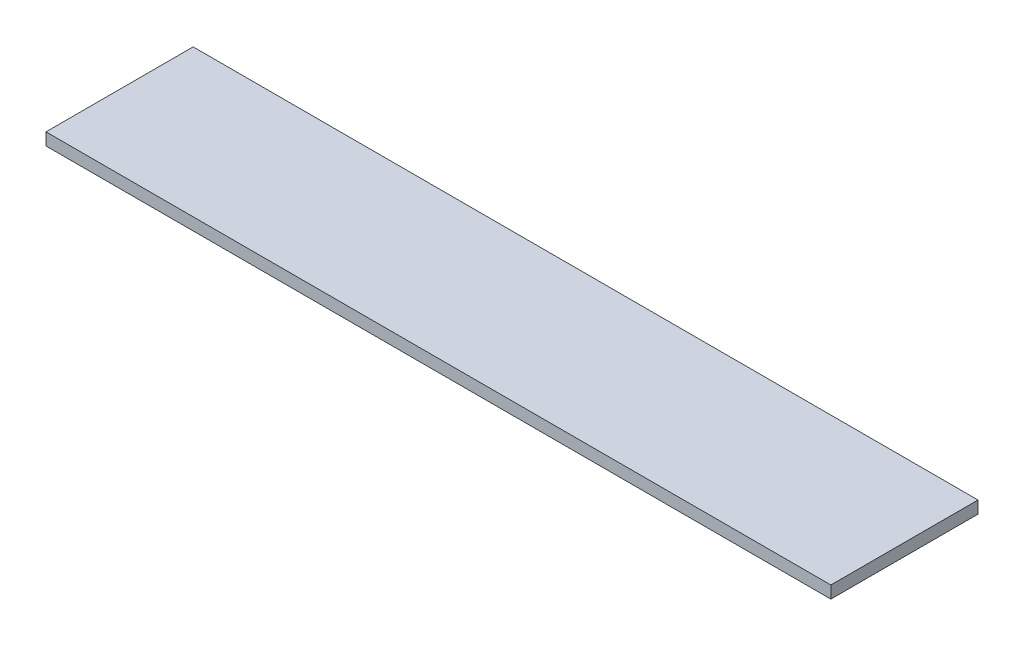
ISO-10303-21;
HEADER;
FILE_DESCRIPTION(('STEP AP214'),'2;1');
FILE_NAME('part.step','',(''),(''),'','','');
FILE_SCHEMA(('AUTOMOTIVE_DESIGN { 1 0 10303 214 1 1 1 1 }'));
ENDSEC;
DATA;
#1=APPLICATION_CONTEXT('core data for automotive mechanical design processes');
#2=APPLICATION_PROTOCOL_DEFINITION('international standard','automotive_design',2000,#1);
#3=PRODUCT_CONTEXT('',#1,'mechanical');
#4=PRODUCT('Part','Part','',(#3));
#5=PRODUCT_RELATED_PRODUCT_CATEGORY('part','',(#4));
#6=PRODUCT_DEFINITION_FORMATION('','',#4);
#7=PRODUCT_DEFINITION_CONTEXT('part definition',#1,'design');
#8=PRODUCT_DEFINITION('design','',#6,#7);
#9=PRODUCT_DEFINITION_SHAPE('','',#8);
#10=(LENGTH_UNIT() NAMED_UNIT(*) SI_UNIT(.MILLI.,.METRE.));
#11=(NAMED_UNIT(*) PLANE_ANGLE_UNIT() SI_UNIT($,.RADIAN.));
#12=(NAMED_UNIT(*) SI_UNIT($,.STERADIAN.) SOLID_ANGLE_UNIT());
#13=UNCERTAINTY_MEASURE_WITH_UNIT(LENGTH_MEASURE(1.E-05),#10,'distance_accuracy_value','');
#14=(GEOMETRIC_REPRESENTATION_CONTEXT(3) GLOBAL_UNCERTAINTY_ASSIGNED_CONTEXT((#13)) GLOBAL_UNIT_ASSIGNED_CONTEXT((#10,
#11,#12)) REPRESENTATION_CONTEXT('',''));
#15=CARTESIAN_POINT('',(0.,0.,0.));
#16=DIRECTION('',(0.,0.,1.));
#17=DIRECTION('',(1.,0.,0.));
#18=AXIS2_PLACEMENT_3D('',#15,#16,#17);
#19=CARTESIAN_POINT('',(0.,6.35000000000008,0.));
#20=DIRECTION('',(1.,0.,0.));
#21=DIRECTION('',(0.,0.,-1.));
#22=AXIS2_PLACEMENT_3D('',#19,#20,#21);
#23=PLANE('',#22);
#24=DIRECTION('',(0.,0.,1.));
#25=VECTOR('',#24,1.);
#26=CARTESIAN_POINT('',(0.,0.,0.));
#27=LINE('',#26,#25);
#28=CARTESIAN_POINT('',(0.,0.,-76.2));
#29=VERTEX_POINT('',#28);
#30=CARTESIAN_POINT('',(0.,0.,0.));
#31=VERTEX_POINT('',#30);
#32=EDGE_CURVE('E97',#29,#31,#27,.T.);
#33=ORIENTED_EDGE('',*,*,#32,.T.);
#34=DIRECTION('',(0.,-1.,0.));
#35=VECTOR('',#34,1.);
#36=CARTESIAN_POINT('',(0.,6.35000000000008,0.));
#37=LINE('',#36,#35);
#38=CARTESIAN_POINT('',(0.,6.35000000000008,0.));
#39=VERTEX_POINT('',#38);
#40=EDGE_CURVE('E11',#39,#31,#37,.T.);
#41=ORIENTED_EDGE('',*,*,#40,.F.);
#42=DIRECTION('',(0.,0.,1.));
#43=VECTOR('',#42,1.);
#44=CARTESIAN_POINT('',(0.,6.35000000000008,0.));
#45=LINE('',#44,#43);
#46=CARTESIAN_POINT('',(0.,6.35000000000008,-76.2));
#47=VERTEX_POINT('',#46);
#48=EDGE_CURVE('E85',#47,#39,#45,.T.);
#49=ORIENTED_EDGE('',*,*,#48,.F.);
#50=DIRECTION('',(0.,-1.,0.));
#51=VECTOR('',#50,1.);
#52=CARTESIAN_POINT('',(0.,6.35000000000008,-76.2));
#53=LINE('',#52,#51);
#54=EDGE_CURVE('E93',#47,#29,#53,.T.);
#55=ORIENTED_EDGE('',*,*,#54,.T.);
#56=EDGE_LOOP('',(#33,#41,#49,#55));
#57=FACE_BOUND('',#56,.T.);
#58=ADVANCED_FACE('F34',(#57),#23,.F.);
#59=CARTESIAN_POINT('',(0.,6.35000000000008,0.));
#60=DIRECTION('',(0.,0.,-1.));
#61=DIRECTION('',(-1.,0.,0.));
#62=AXIS2_PLACEMENT_3D('',#59,#60,#61);
#63=PLANE('',#62);
#64=DIRECTION('',(1.,0.,0.));
#65=VECTOR('',#64,1.);
#66=CARTESIAN_POINT('',(0.,0.,0.));
#67=LINE('',#66,#65);
#68=CARTESIAN_POINT('',(406.4,0.,0.));
#69=VERTEX_POINT('',#68);
#70=EDGE_CURVE('E89',#31,#69,#67,.T.);
#71=ORIENTED_EDGE('',*,*,#70,.T.);
#72=DIRECTION('',(0.,-1.,0.));
#73=VECTOR('',#72,1.);
#74=CARTESIAN_POINT('',(406.4,6.35000000000008,0.));
#75=LINE('',#74,#73);
#76=CARTESIAN_POINT('',(406.4,6.35000000000008,0.));
#77=VERTEX_POINT('',#76);
#78=EDGE_CURVE('E42',#77,#69,#75,.T.);
#79=ORIENTED_EDGE('',*,*,#78,.F.);
#80=DIRECTION('',(1.,0.,0.));
#81=VECTOR('',#80,1.);
#82=CARTESIAN_POINT('',(0.,6.35000000000008,0.));
#83=LINE('',#82,#81);
#84=EDGE_CURVE('E80',#39,#77,#83,.T.);
#85=ORIENTED_EDGE('',*,*,#84,.F.);
#86=ORIENTED_EDGE('',*,*,#40,.T.);
#87=EDGE_LOOP('',(#71,#79,#85,#86));
#88=FACE_BOUND('',#87,.T.);
#89=ADVANCED_FACE('F88',(#88),#63,.F.);
#90=CARTESIAN_POINT('',(406.4,6.35000000000008,0.));
#91=DIRECTION('',(-1.,0.,0.));
#92=DIRECTION('',(0.,0.,1.));
#93=AXIS2_PLACEMENT_3D('',#90,#91,#92);
#94=PLANE('',#93);
#95=DIRECTION('',(0.,0.,-1.));
#96=VECTOR('',#95,1.);
#97=CARTESIAN_POINT('',(406.4,0.,0.));
#98=LINE('',#97,#96);
#99=CARTESIAN_POINT('',(406.4,0.,-76.2));
#100=VERTEX_POINT('',#99);
#101=EDGE_CURVE('E67',#69,#100,#98,.T.);
#102=ORIENTED_EDGE('',*,*,#101,.T.);
#103=DIRECTION('',(0.,-1.,0.));
#104=VECTOR('',#103,1.);
#105=CARTESIAN_POINT('',(406.4,6.35000000000008,-76.2));
#106=LINE('',#105,#104);
#107=CARTESIAN_POINT('',(406.4,6.35000000000008,-76.2));
#108=VERTEX_POINT('',#107);
#109=EDGE_CURVE('E90',#108,#100,#106,.T.);
#110=ORIENTED_EDGE('',*,*,#109,.F.);
#111=DIRECTION('',(0.,0.,-1.));
#112=VECTOR('',#111,1.);
#113=CARTESIAN_POINT('',(406.4,6.35000000000008,0.));
#114=LINE('',#113,#112);
#115=EDGE_CURVE('E83',#77,#108,#114,.T.);
#116=ORIENTED_EDGE('',*,*,#115,.F.);
#117=ORIENTED_EDGE('',*,*,#78,.T.);
#118=EDGE_LOOP('',(#102,#110,#116,#117));
#119=FACE_BOUND('',#118,.T.);
#120=ADVANCED_FACE('F91',(#119),#94,.F.);
#121=CARTESIAN_POINT('',(0.,6.35000000000008,-76.2));
#122=DIRECTION('',(0.,0.,1.));
#123=DIRECTION('',(1.,0.,0.));
#124=AXIS2_PLACEMENT_3D('',#121,#122,#123);
#125=PLANE('',#124);
#126=DIRECTION('',(-1.,0.,0.));
#127=VECTOR('',#126,1.);
#128=CARTESIAN_POINT('',(0.,0.,-76.2));
#129=LINE('',#128,#127);
#130=EDGE_CURVE('E73',#100,#29,#129,.T.);
#131=ORIENTED_EDGE('',*,*,#130,.T.);
#132=ORIENTED_EDGE('',*,*,#54,.F.);
#133=DIRECTION('',(-1.,0.,0.));
#134=VECTOR('',#133,1.);
#135=CARTESIAN_POINT('',(0.,6.35000000000008,-76.2));
#136=LINE('',#135,#134);
#137=EDGE_CURVE('E50',#108,#47,#136,.T.);
#138=ORIENTED_EDGE('',*,*,#137,.F.);
#139=ORIENTED_EDGE('',*,*,#109,.T.);
#140=EDGE_LOOP('',(#131,#132,#138,#139));
#141=FACE_BOUND('',#140,.T.);
#142=ADVANCED_FACE('F104',(#141),#125,.F.);
#143=CARTESIAN_POINT('',(0.,6.35000000000008,0.));
#144=DIRECTION('',(0.,-1.,0.));
#145=DIRECTION('',(0.,0.,-1.));
#146=AXIS2_PLACEMENT_3D('',#143,#144,#145);
#147=PLANE('',#146);
#148=ORIENTED_EDGE('',*,*,#48,.T.);
#149=ORIENTED_EDGE('',*,*,#84,.T.);
#150=ORIENTED_EDGE('',*,*,#115,.T.);
#151=ORIENTED_EDGE('',*,*,#137,.T.);
#152=EDGE_LOOP('',(#148,#149,#150,#151));
#153=FACE_BOUND('',#152,.T.);
#154=ADVANCED_FACE('F81',(#153),#147,.F.);
#155=CARTESIAN_POINT('',(0.,0.,0.));
#156=DIRECTION('',(0.,-1.,0.));
#157=DIRECTION('',(0.,0.,-1.));
#158=AXIS2_PLACEMENT_3D('',#155,#156,#157);
#159=PLANE('',#158);
#160=ORIENTED_EDGE('',*,*,#32,.F.);
#161=ORIENTED_EDGE('',*,*,#130,.F.);
#162=ORIENTED_EDGE('',*,*,#101,.F.);
#163=ORIENTED_EDGE('',*,*,#70,.F.);
#164=EDGE_LOOP('',(#160,#161,#162,#163));
#165=FACE_BOUND('',#164,.T.);
#166=ADVANCED_FACE('F107',(#165),#159,.T.);
#167=CLOSED_SHELL('',(#58,#89,#120,#142,#154,#166));
#168=MANIFOLD_SOLID_BREP('B2',#167);
#169=ADVANCED_BREP_SHAPE_REPRESENTATION('',(#18,#168),#14);
#170=SHAPE_DEFINITION_REPRESENTATION(#9,#169);
ENDSEC;
END-ISO-10303-21;
